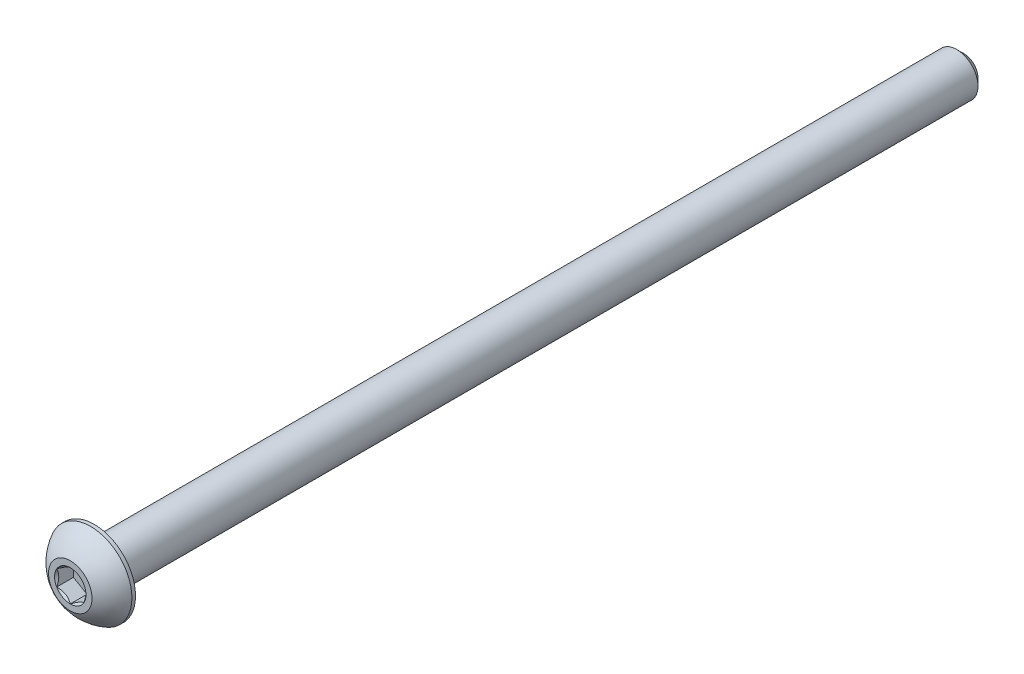
ISO-10303-21;
HEADER;
FILE_DESCRIPTION(('STEP AP214'),'2;1');
FILE_NAME('part.step','',(''),(''),'','','');
FILE_SCHEMA(('AUTOMOTIVE_DESIGN { 1 0 10303 214 1 1 1 1 }'));
ENDSEC;
DATA;
#1=APPLICATION_CONTEXT('core data for automotive mechanical design processes');
#2=APPLICATION_PROTOCOL_DEFINITION('international standard','automotive_design',2000,#1);
#3=PRODUCT_CONTEXT('',#1,'mechanical');
#4=PRODUCT('Part','Part','',(#3));
#5=PRODUCT_RELATED_PRODUCT_CATEGORY('part','',(#4));
#6=PRODUCT_DEFINITION_FORMATION('','',#4);
#7=PRODUCT_DEFINITION_CONTEXT('part definition',#1,'design');
#8=PRODUCT_DEFINITION('design','',#6,#7);
#9=PRODUCT_DEFINITION_SHAPE('','',#8);
#10=(LENGTH_UNIT() NAMED_UNIT(*) SI_UNIT(.MILLI.,.METRE.));
#11=(NAMED_UNIT(*) PLANE_ANGLE_UNIT() SI_UNIT($,.RADIAN.));
#12=(NAMED_UNIT(*) SI_UNIT($,.STERADIAN.) SOLID_ANGLE_UNIT());
#13=UNCERTAINTY_MEASURE_WITH_UNIT(LENGTH_MEASURE(1.E-05),#10,'distance_accuracy_value','');
#14=(GEOMETRIC_REPRESENTATION_CONTEXT(3) GLOBAL_UNCERTAINTY_ASSIGNED_CONTEXT((#13)) GLOBAL_UNIT_ASSIGNED_CONTEXT((#10,
#11,#12)) REPRESENTATION_CONTEXT('',''));
#15=CARTESIAN_POINT('',(0.,0.,0.));
#16=DIRECTION('',(0.,0.,1.));
#17=DIRECTION('',(1.,0.,0.));
#18=AXIS2_PLACEMENT_3D('',#15,#16,#17);
#19=CARTESIAN_POINT('',(1.25,-0.721687836487033,0.660000000000001));
#20=DIRECTION('',(0.,0.,1.));
#21=DIRECTION('',(1.,0.,0.));
#22=AXIS2_PLACEMENT_3D('',#19,#20,#21);
#23=PLANE('',#22);
#24=DIRECTION('',(0.,1.,0.));
#25=VECTOR('',#24,1.);
#26=CARTESIAN_POINT('',(-1.25,0.721687836487031,0.660000000000001));
#27=LINE('',#26,#25);
#28=CARTESIAN_POINT('',(-1.25,0.721687836487031,0.660000000000001));
#29=VERTEX_POINT('',#28);
#30=CARTESIAN_POINT('',(-1.25,-0.721687836487033,0.660000000000001));
#31=VERTEX_POINT('',#30);
#32=EDGE_CURVE('E67',#29,#31,#27,.F.);
#33=ORIENTED_EDGE('',*,*,#32,.T.);
#34=DIRECTION('',(0.866025403784439,-0.5,0.));
#35=VECTOR('',#34,1.);
#36=CARTESIAN_POINT('',(-1.25,-0.721687836487033,0.660000000000001));
#37=LINE('',#36,#35);
#38=CARTESIAN_POINT('',(0.,-1.44337567297406,0.660000000000001));
#39=VERTEX_POINT('',#38);
#40=EDGE_CURVE('E81',#31,#39,#37,.T.);
#41=ORIENTED_EDGE('',*,*,#40,.T.);
#42=DIRECTION('',(0.866025403784438,0.5,0.));
#43=VECTOR('',#42,1.);
#44=CARTESIAN_POINT('',(0.,-1.44337567297406,0.660000000000001));
#45=LINE('',#44,#43);
#46=CARTESIAN_POINT('',(1.25,-0.721687836487033,0.660000000000001));
#47=VERTEX_POINT('',#46);
#48=EDGE_CURVE('E84',#39,#47,#45,.T.);
#49=ORIENTED_EDGE('',*,*,#48,.T.);
#50=DIRECTION('',(0.,1.,0.));
#51=VECTOR('',#50,1.);
#52=CARTESIAN_POINT('',(1.25,-0.721687836487031,0.660000000000001));
#53=LINE('',#52,#51);
#54=CARTESIAN_POINT('',(1.25,0.721687836487033,0.660000000000001));
#55=VERTEX_POINT('',#54);
#56=EDGE_CURVE('E93',#47,#55,#53,.T.);
#57=ORIENTED_EDGE('',*,*,#56,.T.);
#58=DIRECTION('',(-0.866025403784439,0.5,0.));
#59=VECTOR('',#58,1.);
#60=CARTESIAN_POINT('',(1.25,0.721687836487033,0.660000000000001));
#61=LINE('',#60,#59);
#62=CARTESIAN_POINT('',(0.,1.44337567297406,0.660000000000001));
#63=VERTEX_POINT('',#62);
#64=EDGE_CURVE('E385',#55,#63,#61,.T.);
#65=ORIENTED_EDGE('',*,*,#64,.T.);
#66=DIRECTION('',(-0.866025403784438,-0.5,0.));
#67=VECTOR('',#66,1.);
#68=CARTESIAN_POINT('',(0.,1.44337567297406,0.660000000000001));
#69=LINE('',#68,#67);
#70=EDGE_CURVE('E72',#63,#29,#69,.T.);
#71=ORIENTED_EDGE('',*,*,#70,.T.);
#72=EDGE_LOOP('',(#33,#41,#49,#57,#65,#71));
#73=FACE_BOUND('',#72,.T.);
#74=ADVANCED_FACE('F17',(#73),#23,.T.);
#75=CARTESIAN_POINT('',(-1.25,-0.721687836487033,0.660000000000001));
#76=DIRECTION('',(-0.5,-0.866025403784439,0.));
#77=DIRECTION('',(0.866025403784439,-0.5,0.));
#78=AXIS2_PLACEMENT_3D('',#75,#76,#77);
#79=PLANE('',#78);
#80=CARTESIAN_POINT('',(-1.2500000000039,-0.721687836475546,2.1999999999651));
#81=CARTESIAN_POINT('',(-1.20703689150303,-0.746492598739661,2.17521903968037));
#82=CARTESIAN_POINT('',(-1.16335543596248,-0.771712098857023,2.15189374942367));
#83=CARTESIAN_POINT('',(-1.07428446544517,-0.823137247663963,2.10918613886925));
#84=CARTESIAN_POINT('',(-1.02888648444312,-0.849347784215502,2.08982757330815));
#85=CARTESIAN_POINT('',(-0.937343688529335,-0.902200042078223,2.05666621586141));
#86=CARTESIAN_POINT('',(-0.891222174148737,-0.928828310821467,2.04278009673133));
#87=CARTESIAN_POINT('',(-0.79796403889798,-0.982670920312739,2.02138590174697));
#88=CARTESIAN_POINT('',(-0.750830264939867,-1.00988361739533,2.0138618618684));
#89=CARTESIAN_POINT('',(-0.66959091352769,-1.05678717880192,2.00707282774254));
#90=CARTESIAN_POINT('',(-0.635590177990322,-1.07641751261707,2.00606818860084));
#91=CARTESIAN_POINT('',(-0.567648554681464,-1.11564362712362,2.00776349516696));
#92=CARTESIAN_POINT('',(-0.53370768178827,-1.13523939922504,2.01046425920708));
#93=CARTESIAN_POINT('',(-0.466153619741846,-1.17424175513239,2.01941424829));
#94=CARTESIAN_POINT('',(-0.43254076490354,-1.19364814592152,2.02566677300209));
#95=CARTESIAN_POINT('',(-0.365876260763852,-1.23213691533196,2.04138353918999));
#96=CARTESIAN_POINT('',(-0.332824858674677,-1.25121915122524,2.05084915880269));
#97=CARTESIAN_POINT('',(-0.248213569939122,-1.3000695015532,2.07892833152472));
#98=CARTESIAN_POINT('',(-0.197186124432365,-1.32953021095258,2.09964934500926));
#99=CARTESIAN_POINT('',(-0.0971276056170728,-1.38729902372531,2.14632350576772));
#100=CARTESIAN_POINT('',(-0.0480906425307946,-1.41561052756341,2.17225962118124));
#101=CARTESIAN_POINT('',(8.85398045385281E-12,-1.44337567297918,2.19999999996127));
#102=B_SPLINE_CURVE_WITH_KNOTS('',3,(#80,#81,#82,#83,#84,#85,#86,#87,#88,#89,#90,#91,#92,#93,
#94,#95,#96,#97,#98,#99,#100,#101),.UNSPECIFIED.,.F.,.F.,(4,2,2,2,2,2,2,2,2,2,4),(0.,
0.166478683227499,0.333926926836022,0.498716658522913,0.663091654634356,0.780745575566096,
0.898425484358887,1.01621489977747,1.13405490053145,1.32111591643007,1.50757565760963),.UNSPECIFIED.);
#103=CARTESIAN_POINT('',(-1.25000000000471,-0.721687836489752,2.1999999999616));
#104=VERTEX_POINT('',#103);
#105=CARTESIAN_POINT('',(0.,-1.4433756729795,2.19999999996159));
#106=VERTEX_POINT('',#105);
#107=EDGE_CURVE('E20',#104,#106,#102,.T.);
#108=ORIENTED_EDGE('',*,*,#107,.T.);
#109=DIRECTION('',(0.,0.,1.));
#110=VECTOR('',#109,1.);
#111=CARTESIAN_POINT('',(0.,-1.44337567297406,0.660000000000001));
#112=LINE('',#111,#110);
#113=EDGE_CURVE('E88',#106,#39,#112,.F.);
#114=ORIENTED_EDGE('',*,*,#113,.T.);
#115=ORIENTED_EDGE('',*,*,#40,.F.);
#116=DIRECTION('',(0.,0.,1.));
#117=VECTOR('',#116,1.);
#118=CARTESIAN_POINT('',(-1.25,-0.721687836487033,0.660000000000001));
#119=LINE('',#118,#117);
#120=EDGE_CURVE('E59',#31,#104,#119,.T.);
#121=ORIENTED_EDGE('',*,*,#120,.T.);
#122=EDGE_LOOP('',(#108,#114,#115,#121));
#123=FACE_BOUND('',#122,.T.);
#124=ADVANCED_FACE('F89',(#123),#79,.F.);
#125=CARTESIAN_POINT('',(0.,-1.44337567297406,0.660000000000001));
#126=DIRECTION('',(0.5,-0.866025403784438,0.));
#127=DIRECTION('',(0.866025403784438,0.5,0.));
#128=AXIS2_PLACEMENT_3D('',#125,#126,#127);
#129=PLANE('',#128);
#130=CARTESIAN_POINT('',(-1.19006923196776E-11,-1.4433756729717,2.1999999999651));
#131=CARTESIAN_POINT('',(0.0429631084940952,-1.41857091071645,2.17521903968037));
#132=CARTESIAN_POINT('',(0.0866445640367501,-1.39335141060274,2.15189374942367));
#133=CARTESIAN_POINT('',(0.17571553455561,-1.34192626179848,2.10918613886925));
#134=CARTESIAN_POINT('',(0.221113515557087,-1.31571572524595,2.08982757330815));
#135=CARTESIAN_POINT('',(0.312656311470462,-1.26286346738252,2.05666621586141));
#136=CARTESIAN_POINT('',(0.35877782585121,-1.23623519863954,2.04278009673133));
#137=CARTESIAN_POINT('',(0.452035961102074,-1.18239258914845,2.02138590174697));
#138=CARTESIAN_POINT('',(0.499169735060145,-1.15517989206579,2.01386186186839));
#139=CARTESIAN_POINT('',(0.580409086472302,-1.10827633065917,2.00707282774254));
#140=CARTESIAN_POINT('',(0.614409822009676,-1.08864599684402,2.00606818860084));
#141=CARTESIAN_POINT('',(0.682351445318539,-1.04941988233748,2.00776349516696));
#142=CARTESIAN_POINT('',(0.71629231821173,-1.02982411023606,2.01046425920707));
#143=CARTESIAN_POINT('',(0.783846380258153,-0.990821754328704,2.01941424829));
#144=CARTESIAN_POINT('',(0.81745923509646,-0.971415363539577,2.02566677300209));
#145=CARTESIAN_POINT('',(0.884123739236149,-0.932926594129135,2.04138353918999));
#146=CARTESIAN_POINT('',(0.917175141325323,-0.913844358235855,2.05084915880269));
#147=CARTESIAN_POINT('',(1.00178643006088,-0.864994007907901,2.07892833152472));
#148=CARTESIAN_POINT('',(1.05281387556764,-0.835533298508516,2.09964934500926));
#149=CARTESIAN_POINT('',(1.15287239438293,-0.777764485735792,2.14632350576771));
#150=CARTESIAN_POINT('',(1.20190935746921,-0.749452981897688,2.17225962118124));
#151=CARTESIAN_POINT('',(1.25000000000885,-0.721687836481919,2.19999999996127));
#152=B_SPLINE_CURVE_WITH_KNOTS('',3,(#130,#131,#132,#133,#134,#135,#136,#137,#138,#139,#140,
#141,#142,#143,#144,#145,#146,#147,#148,#149,#150,#151),.UNSPECIFIED.,.F.,.F.,(4,2,2,2,2,2,2,2,
2,2,4),(0.,0.166478683227499,0.333926926836022,0.498716658522913,0.663091654634357,
0.780745575566097,0.898425484358887,1.01621489977747,1.13405490053145,1.32111591643007,
1.50757565760963),.UNSPECIFIED.);
#153=CARTESIAN_POINT('',(1.25000000000471,-0.721687836489752,2.19999999996159));
#154=VERTEX_POINT('',#153);
#155=EDGE_CURVE('E202',#106,#154,#152,.T.);
#156=ORIENTED_EDGE('',*,*,#155,.T.);
#157=DIRECTION('',(0.,0.,-1.));
#158=VECTOR('',#157,1.);
#159=CARTESIAN_POINT('',(1.25,-0.721687836487033,0.660000000000001));
#160=LINE('',#159,#158);
#161=EDGE_CURVE('E97',#154,#47,#160,.T.);
#162=ORIENTED_EDGE('',*,*,#161,.T.);
#163=ORIENTED_EDGE('',*,*,#48,.F.);
#164=ORIENTED_EDGE('',*,*,#113,.F.);
#165=EDGE_LOOP('',(#156,#162,#163,#164));
#166=FACE_BOUND('',#165,.T.);
#167=ADVANCED_FACE('F95',(#166),#129,.F.);
#168=CARTESIAN_POINT('',(1.25,-0.721687836487031,0.660000000000001));
#169=DIRECTION('',(1.,0.,0.));
#170=DIRECTION('',(0.,0.,-1.));
#171=AXIS2_PLACEMENT_3D('',#168,#169,#170);
#172=PLANE('',#171);
#173=CARTESIAN_POINT('',(1.249999999992,-0.721687836496157,2.1999999999651));
#174=CARTESIAN_POINT('',(1.24999999999712,-0.672078311964272,2.17521903968134));
#175=CARTESIAN_POINT('',(1.24999999999923,-0.621639311720596,2.15189374942613));
#176=CARTESIAN_POINT('',(1.25000000000078,-0.518789014084217,2.10918613887607));
#177=CARTESIAN_POINT('',(1.2500000000002,-0.466367940967567,2.08982757331785));
#178=CARTESIAN_POINT('',(1.2499999999998,-0.36066342521691,2.05666621587858));
#179=CARTESIAN_POINT('',(1.24999999999994,-0.307406887718766,2.04278009675303));
#180=CARTESIAN_POINT('',(1.25000000000005,-0.19972166871319,2.0213859017793));
#181=CARTESIAN_POINT('',(1.25000000000001,-0.145296274536628,2.01386186190683));
#182=CARTESIAN_POINT('',(1.24999999999999,-0.0514891516972088,2.00707282779183));
#183=CARTESIAN_POINT('',(1.25,-0.0122284840517459,2.00606818865533));
#184=CARTESIAN_POINT('',(1.25,0.0662237449911266,2.00776349523351));
#185=CARTESIAN_POINT('',(1.25,0.105415289208559,2.0104642592805));
#186=CARTESIAN_POINT('',(1.25,0.183420001051808,2.01941424837839));
#187=CARTESIAN_POINT('',(1.25,0.222232782644,2.02566677309857));
#188=CARTESIAN_POINT('',(1.25,0.299210321492129,2.04138353930337));
#189=CARTESIAN_POINT('',(1.25,0.337374793291997,2.05084915892488));
#190=CARTESIAN_POINT('',(1.25,0.435075493903884,2.07892833164773));
#191=CARTESIAN_POINT('',(1.25,0.49399691264761,2.09964934511544));
#192=CARTESIAN_POINT('',(1.25,0.609534538087598,2.14632350582834));
#193=CARTESIAN_POINT('',(1.25,0.666157545713388,2.17225962121314));
#194=CARTESIAN_POINT('',(1.25,0.721687836497259,2.19999999996127));
#195=B_SPLINE_CURVE_WITH_KNOTS('',3,(#173,#174,#175,#176,#177,#178,#179,#180,#181,#182,#183,
#184,#185,#186,#187,#188,#189,#190,#191,#192,#193,#194),.UNSPECIFIED.,.F.,.F.,(4,2,2,2,2,2,2,2,
2,2,4),(0.,0.166478683259841,0.333926926900715,0.498716658618658,0.663091654761128,
0.780745575737858,0.898425484575692,1.01621490003938,1.13405490083847,1.32111591656578,
1.50757565757345),.UNSPECIFIED.);
#196=CARTESIAN_POINT('',(1.25000000000471,0.721687836489753,2.19999999996159));
#197=VERTEX_POINT('',#196);
#198=EDGE_CURVE('E184',#154,#197,#195,.T.);
#199=ORIENTED_EDGE('',*,*,#198,.T.);
#200=DIRECTION('',(0.,0.,1.));
#201=VECTOR('',#200,1.);
#202=CARTESIAN_POINT('',(1.25,0.721687836487033,0.660000000000001));
#203=LINE('',#202,#201);
#204=EDGE_CURVE('E378',#197,#55,#203,.F.);
#205=ORIENTED_EDGE('',*,*,#204,.T.);
#206=ORIENTED_EDGE('',*,*,#56,.F.);
#207=ORIENTED_EDGE('',*,*,#161,.F.);
#208=EDGE_LOOP('',(#199,#205,#206,#207));
#209=FACE_BOUND('',#208,.T.);
#210=ADVANCED_FACE('F174',(#209),#172,.F.);
#211=CARTESIAN_POINT('',(1.25,0.721687836487033,0.660000000000001));
#212=DIRECTION('',(0.5,0.866025403784439,0.));
#213=DIRECTION('',(-0.866025403784439,0.5,0.));
#214=AXIS2_PLACEMENT_3D('',#211,#212,#213);
#215=PLANE('',#214);
#216=CARTESIAN_POINT('',(1.2500000000039,0.721687836475545,2.1999999999651));
#217=CARTESIAN_POINT('',(1.20703689150303,0.746492598739661,2.17521903968037));
#218=CARTESIAN_POINT('',(1.16335543596248,0.771712098857023,2.15189374942367));
#219=CARTESIAN_POINT('',(1.07428446544517,0.823137247663962,2.10918613886925));
#220=CARTESIAN_POINT('',(1.02888648444312,0.849347784215501,2.08982757330815));
#221=CARTESIAN_POINT('',(0.937343688529333,0.902200042078223,2.05666621586141));
#222=CARTESIAN_POINT('',(0.891222174148735,0.928828310821467,2.04278009673133));
#223=CARTESIAN_POINT('',(0.797964038897979,0.982670920312738,2.02138590174697));
#224=CARTESIAN_POINT('',(0.750830264939866,1.00988361739533,2.0138618618684));
#225=CARTESIAN_POINT('',(0.669590913527689,1.05678717880192,2.00707282774254));
#226=CARTESIAN_POINT('',(0.63559017799032,1.07641751261707,2.00606818860084));
#227=CARTESIAN_POINT('',(0.567648554681463,1.11564362712362,2.00776349516696));
#228=CARTESIAN_POINT('',(0.533707681788269,1.13523939922504,2.01046425920707));
#229=CARTESIAN_POINT('',(0.466153619741845,1.17424175513239,2.01941424829));
#230=CARTESIAN_POINT('',(0.432540764903539,1.19364814592152,2.02566677300209));
#231=CARTESIAN_POINT('',(0.365876260763851,1.23213691533196,2.04138353918999));
#232=CARTESIAN_POINT('',(0.332824858674676,1.25121915122524,2.05084915880269));
#233=CARTESIAN_POINT('',(0.248213569939121,1.3000695015532,2.07892833152472));
#234=CARTESIAN_POINT('',(0.197186124432363,1.32953021095258,2.09964934500926));
#235=CARTESIAN_POINT('',(0.0971276056170708,1.3872990237253,2.14632350576771));
#236=CARTESIAN_POINT('',(0.0480906425307926,1.41561052756341,2.17225962118124));
#237=CARTESIAN_POINT('',(-8.85587803845252E-12,1.44337567297918,2.19999999996127));
#238=B_SPLINE_CURVE_WITH_KNOTS('',3,(#216,#217,#218,#219,#220,#221,#222,#223,#224,#225,#226,
#227,#228,#229,#230,#231,#232,#233,#234,#235,#236,#237),.UNSPECIFIED.,.F.,.F.,(4,2,2,2,2,2,2,2,
2,2,4),(0.,0.166478683227499,0.333926926836022,0.498716658522912,0.663091654634356,
0.780745575566096,0.898425484358886,1.01621489977747,1.13405490053145,1.32111591643007,
1.50757565760963),.UNSPECIFIED.);
#239=CARTESIAN_POINT('',(0.,1.4433756729795,2.19999999996159));
#240=VERTEX_POINT('',#239);
#241=EDGE_CURVE('E178',#197,#240,#238,.T.);
#242=ORIENTED_EDGE('',*,*,#241,.T.);
#243=DIRECTION('',(0.,0.,1.));
#244=VECTOR('',#243,1.);
#245=CARTESIAN_POINT('',(0.,1.44337567297406,0.660000000000001));
#246=LINE('',#245,#244);
#247=EDGE_CURVE('E413',#240,#63,#246,.F.);
#248=ORIENTED_EDGE('',*,*,#247,.T.);
#249=ORIENTED_EDGE('',*,*,#64,.F.);
#250=ORIENTED_EDGE('',*,*,#204,.F.);
#251=EDGE_LOOP('',(#242,#248,#249,#250));
#252=FACE_BOUND('',#251,.T.);
#253=ADVANCED_FACE('F170',(#252),#215,.F.);
#254=CARTESIAN_POINT('',(0.,1.44337567297406,0.660000000000001));
#255=DIRECTION('',(-0.5,0.866025403784438,0.));
#256=DIRECTION('',(-0.866025403784438,-0.5,0.));
#257=AXIS2_PLACEMENT_3D('',#254,#255,#256);
#258=PLANE('',#257);
#259=CARTESIAN_POINT('',(1.19001542096313E-11,1.4433756729717,2.1999999999651));
#260=CARTESIAN_POINT('',(-0.0429631084940957,1.41857091071645,2.17521903968037));
#261=CARTESIAN_POINT('',(-0.0866445640367506,1.39335141060274,2.15189374942367));
#262=CARTESIAN_POINT('',(-0.175715534555611,1.34192626179848,2.10918613886925));
#263=CARTESIAN_POINT('',(-0.221113515557087,1.31571572524595,2.08982757330815));
#264=CARTESIAN_POINT('',(-0.312656311470463,1.26286346738252,2.05666621586141));
#265=CARTESIAN_POINT('',(-0.358777825851211,1.23623519863954,2.04278009673133));
#266=CARTESIAN_POINT('',(-0.452035961102075,1.18239258914845,2.02138590174697));
#267=CARTESIAN_POINT('',(-0.499169735060146,1.15517989206579,2.01386186186839));
#268=CARTESIAN_POINT('',(-0.580409086472302,1.10827633065917,2.00707282774254));
#269=CARTESIAN_POINT('',(-0.614409822009677,1.08864599684402,2.00606818860084));
#270=CARTESIAN_POINT('',(-0.682351445318539,1.04941988233748,2.00776349516696));
#271=CARTESIAN_POINT('',(-0.716292318211731,1.02982411023606,2.01046425920707));
#272=CARTESIAN_POINT('',(-0.783846380258154,0.990821754328704,2.01941424829));
#273=CARTESIAN_POINT('',(-0.817459235096461,0.971415363539576,2.02566677300209));
#274=CARTESIAN_POINT('',(-0.884123739236149,0.932926594129135,2.04138353918999));
#275=CARTESIAN_POINT('',(-0.917175141325324,0.913844358235855,2.05084915880269));
#276=CARTESIAN_POINT('',(-1.00178643006088,0.864994007907901,2.07892833152472));
#277=CARTESIAN_POINT('',(-1.05281387556764,0.835533298508516,2.09964934500926));
#278=CARTESIAN_POINT('',(-1.15287239438293,0.777764485735791,2.14632350576771));
#279=CARTESIAN_POINT('',(-1.20190935746921,0.749452981897687,2.17225962118124));
#280=CARTESIAN_POINT('',(-1.25000000000886,0.721687836481918,2.19999999996127));
#281=B_SPLINE_CURVE_WITH_KNOTS('',3,(#259,#260,#261,#262,#263,#264,#265,#266,#267,#268,#269,
#270,#271,#272,#273,#274,#275,#276,#277,#278,#279,#280),.UNSPECIFIED.,.F.,.F.,(4,2,2,2,2,2,2,2,
2,2,4),(0.,0.166478683227499,0.333926926836022,0.498716658522913,0.663091654634357,
0.780745575566097,0.898425484358888,1.01621489977747,1.13405490053145,1.32111591643007,
1.50757565760964),.UNSPECIFIED.);
#282=CARTESIAN_POINT('',(-1.25000000000471,0.72168783648975,2.19999999996159));
#283=VERTEX_POINT('',#282);
#284=EDGE_CURVE('E40',#240,#283,#281,.T.);
#285=ORIENTED_EDGE('',*,*,#284,.T.);
#286=DIRECTION('',(0.,0.,1.));
#287=VECTOR('',#286,1.);
#288=CARTESIAN_POINT('',(-1.25,0.721687836487031,0.660000000000001));
#289=LINE('',#288,#287);
#290=EDGE_CURVE('E403',#283,#29,#289,.F.);
#291=ORIENTED_EDGE('',*,*,#290,.T.);
#292=ORIENTED_EDGE('',*,*,#70,.F.);
#293=ORIENTED_EDGE('',*,*,#247,.F.);
#294=EDGE_LOOP('',(#285,#291,#292,#293));
#295=FACE_BOUND('',#294,.T.);
#296=ADVANCED_FACE('F163',(#295),#258,.F.);
#297=CARTESIAN_POINT('',(-1.25,0.721687836487031,0.660000000000001));
#298=DIRECTION('',(-1.,0.,0.));
#299=DIRECTION('',(0.,0.,1.));
#300=AXIS2_PLACEMENT_3D('',#297,#298,#299);
#301=PLANE('',#300);
#302=CARTESIAN_POINT('',(-1.249999999992,0.721687836496154,2.1999999999651));
#303=CARTESIAN_POINT('',(-1.24999999999712,0.672078311964269,2.17521903968135));
#304=CARTESIAN_POINT('',(-1.24999999999923,0.621639311720593,2.15189374942613));
#305=CARTESIAN_POINT('',(-1.25000000000078,0.518789014084214,2.10918613887607));
#306=CARTESIAN_POINT('',(-1.25000000000021,0.466367940967565,2.08982757331786));
#307=CARTESIAN_POINT('',(-1.2499999999998,0.360663425216908,2.05666621587858));
#308=CARTESIAN_POINT('',(-1.24999999999995,0.307406887718764,2.04278009675303));
#309=CARTESIAN_POINT('',(-1.25000000000005,0.199721668713189,2.0213859017793));
#310=CARTESIAN_POINT('',(-1.25000000000001,0.145296274536628,2.01386186190683));
#311=CARTESIAN_POINT('',(-1.24999999999999,0.0514891516972085,2.00707282779183));
#312=CARTESIAN_POINT('',(-1.25,0.0122284840517456,2.00606818865533));
#313=CARTESIAN_POINT('',(-1.25,-0.066223744991127,2.00776349523352));
#314=CARTESIAN_POINT('',(-1.25,-0.10541528920856,2.01046425928051));
#315=CARTESIAN_POINT('',(-1.25,-0.183420001051808,2.01941424837839));
#316=CARTESIAN_POINT('',(-1.25,-0.222232782644,2.02566677309857));
#317=CARTESIAN_POINT('',(-1.25,-0.29921032149213,2.04138353930337));
#318=CARTESIAN_POINT('',(-1.25,-0.337374793291998,2.05084915892488));
#319=CARTESIAN_POINT('',(-1.25,-0.435075493903885,2.07892833164773));
#320=CARTESIAN_POINT('',(-1.25,-0.493996912647611,2.09964934511545));
#321=CARTESIAN_POINT('',(-1.25,-0.609534538087597,2.14632350582834));
#322=CARTESIAN_POINT('',(-1.25,-0.666157545713387,2.17225962121314));
#323=CARTESIAN_POINT('',(-1.25,-0.721687836497258,2.19999999996127));
#324=B_SPLINE_CURVE_WITH_KNOTS('',3,(#302,#303,#304,#305,#306,#307,#308,#309,#310,#311,#312,
#313,#314,#315,#316,#317,#318,#319,#320,#321,#322,#323),.UNSPECIFIED.,.F.,.F.,(4,2,2,2,2,2,2,2,
2,2,4),(0.,0.166478683259841,0.333926926900713,0.498716658618655,0.663091654761124,
0.780745575737854,0.898425484575689,1.01621490003937,1.13405490083847,1.32111591656577,
1.50757565757345),.UNSPECIFIED.);
#325=EDGE_CURVE('E143',#283,#104,#324,.T.);
#326=ORIENTED_EDGE('',*,*,#325,.T.);
#327=ORIENTED_EDGE('',*,*,#120,.F.);
#328=ORIENTED_EDGE('',*,*,#32,.F.);
#329=ORIENTED_EDGE('',*,*,#290,.F.);
#330=EDGE_LOOP('',(#326,#327,#328,#329));
#331=FACE_BOUND('',#330,.T.);
#332=ADVANCED_FACE('F159',(#331),#301,.F.);
#333=CARTESIAN_POINT('',(0.,0.,2.19999999995935));
#334=DIRECTION('',(0.,0.,1.));
#335=DIRECTION('',(1.,0.,0.));
#336=AXIS2_PLACEMENT_3D('',#333,#334,#335);
#337=CONICAL_SURFACE('',#336,1.44337567297725,0.785398163397448);
#338=ORIENTED_EDGE('',*,*,#107,.F.);
#339=CARTESIAN_POINT('',(0.,0.,2.19999999995935));
#340=DIRECTION('',(0.,0.,1.));
#341=DIRECTION('',(1.,0.,0.));
#342=AXIS2_PLACEMENT_3D('',#339,#340,#341);
#343=CIRCLE('',#342,1.44337567297725);
#344=EDGE_CURVE('E151',#104,#106,#343,.T.);
#345=ORIENTED_EDGE('',*,*,#344,.T.);
#346=EDGE_LOOP('',(#338,#345));
#347=FACE_BOUND('',#346,.T.);
#348=ADVANCED_FACE('F162',(#347),#337,.F.);
#349=CARTESIAN_POINT('',(0.,0.,2.19999999995935));
#350=DIRECTION('',(0.,0.,1.));
#351=DIRECTION('',(1.,0.,0.));
#352=AXIS2_PLACEMENT_3D('',#349,#350,#351);
#353=CONICAL_SURFACE('',#352,1.44337567297725,0.785398163397448);
#354=ORIENTED_EDGE('',*,*,#155,.F.);
#355=CARTESIAN_POINT('',(0.,0.,2.19999999995935));
#356=DIRECTION('',(0.,0.,1.));
#357=DIRECTION('',(1.,0.,0.));
#358=AXIS2_PLACEMENT_3D('',#355,#356,#357);
#359=CIRCLE('',#358,1.44337567297725);
#360=EDGE_CURVE('E391',#106,#154,#359,.T.);
#361=ORIENTED_EDGE('',*,*,#360,.T.);
#362=EDGE_LOOP('',(#354,#361));
#363=FACE_BOUND('',#362,.T.);
#364=ADVANCED_FACE('F197',(#363),#353,.F.);
#365=CARTESIAN_POINT('',(0.,0.,2.19999999995935));
#366=DIRECTION('',(0.,0.,1.));
#367=DIRECTION('',(1.,0.,0.));
#368=AXIS2_PLACEMENT_3D('',#365,#366,#367);
#369=CONICAL_SURFACE('',#368,1.44337567297725,0.785398163543548);
#370=CARTESIAN_POINT('',(0.,0.,2.19999999995935));
#371=DIRECTION('',(0.,0.,1.));
#372=DIRECTION('',(1.,0.,0.));
#373=AXIS2_PLACEMENT_3D('',#370,#371,#372);
#374=CIRCLE('',#373,1.44337567297725);
#375=EDGE_CURVE('E387',#154,#197,#374,.T.);
#376=ORIENTED_EDGE('',*,*,#375,.T.);
#377=ORIENTED_EDGE('',*,*,#198,.F.);
#378=EDGE_LOOP('',(#376,#377));
#379=FACE_BOUND('',#378,.T.);
#380=ADVANCED_FACE('F193',(#379),#369,.F.);
#381=CARTESIAN_POINT('',(0.,0.,2.19999999995935));
#382=DIRECTION('',(0.,0.,1.));
#383=DIRECTION('',(1.,0.,0.));
#384=AXIS2_PLACEMENT_3D('',#381,#382,#383);
#385=CONICAL_SURFACE('',#384,1.44337567297725,0.785398163397448);
#386=ORIENTED_EDGE('',*,*,#241,.F.);
#387=CARTESIAN_POINT('',(0.,0.,2.19999999995935));
#388=DIRECTION('',(0.,0.,1.));
#389=DIRECTION('',(1.,0.,0.));
#390=AXIS2_PLACEMENT_3D('',#387,#388,#389);
#391=CIRCLE('',#390,1.44337567297725);
#392=EDGE_CURVE('E390',#197,#240,#391,.T.);
#393=ORIENTED_EDGE('',*,*,#392,.T.);
#394=EDGE_LOOP('',(#386,#393));
#395=FACE_BOUND('',#394,.T.);
#396=ADVANCED_FACE('F190',(#395),#385,.F.);
#397=CARTESIAN_POINT('',(0.,0.,2.19999999995935));
#398=DIRECTION('',(0.,0.,1.));
#399=DIRECTION('',(1.,0.,0.));
#400=AXIS2_PLACEMENT_3D('',#397,#398,#399);
#401=CONICAL_SURFACE('',#400,1.44337567297725,0.785398163397448);
#402=ORIENTED_EDGE('',*,*,#284,.F.);
#403=CARTESIAN_POINT('',(0.,0.,2.19999999995935));
#404=DIRECTION('',(0.,0.,1.));
#405=DIRECTION('',(1.,0.,0.));
#406=AXIS2_PLACEMENT_3D('',#403,#404,#405);
#407=CIRCLE('',#406,1.44337567297725);
#408=EDGE_CURVE('E397',#240,#283,#407,.T.);
#409=ORIENTED_EDGE('',*,*,#408,.T.);
#410=EDGE_LOOP('',(#402,#409));
#411=FACE_BOUND('',#410,.T.);
#412=ADVANCED_FACE('F138',(#411),#401,.F.);
#413=CARTESIAN_POINT('',(0.,0.,2.19999999995935));
#414=DIRECTION('',(0.,0.,1.));
#415=DIRECTION('',(1.,0.,0.));
#416=AXIS2_PLACEMENT_3D('',#413,#414,#415);
#417=CONICAL_SURFACE('',#416,1.44337567297725,0.785398163543548);
#418=ORIENTED_EDGE('',*,*,#325,.F.);
#419=CARTESIAN_POINT('',(0.,0.,2.19999999995935));
#420=DIRECTION('',(0.,0.,1.));
#421=DIRECTION('',(1.,0.,0.));
#422=AXIS2_PLACEMENT_3D('',#419,#420,#421);
#423=CIRCLE('',#422,1.44337567297725);
#424=EDGE_CURVE('E123',#283,#104,#423,.T.);
#425=ORIENTED_EDGE('',*,*,#424,.T.);
#426=EDGE_LOOP('',(#418,#425));
#427=FACE_BOUND('',#426,.T.);
#428=ADVANCED_FACE('F133',(#427),#417,.F.);
#429=CARTESIAN_POINT('',(0.,-2.,2.2));
#430=DIRECTION('',(0.,0.,-1.));
#431=DIRECTION('',(-1.,0.,0.));
#432=AXIS2_PLACEMENT_3D('',#429,#430,#431);
#433=PLANE('',#432);
#434=ORIENTED_EDGE('',*,*,#408,.F.);
#435=ORIENTED_EDGE('',*,*,#392,.F.);
#436=ORIENTED_EDGE('',*,*,#375,.F.);
#437=ORIENTED_EDGE('',*,*,#360,.F.);
#438=ORIENTED_EDGE('',*,*,#344,.F.);
#439=ORIENTED_EDGE('',*,*,#424,.F.);
#440=EDGE_LOOP('',(#434,#435,#436,#437,#438,#439));
#441=FACE_BOUND('',#440,.T.);
#442=CARTESIAN_POINT('',(0.,2.00000000000002,2.2));
#443=CARTESIAN_POINT('',(-0.112340883932911,1.99999501830892,2.20000000000006));
#444=CARTESIAN_POINT('',(-0.224763225593509,1.99050288387284,2.20000000000027));
#445=CARTESIAN_POINT('',(-0.44651172679388,1.95276859922379,2.19999999999973));
#446=CARTESIAN_POINT('',(-0.555833994612159,1.92450388247339,2.19999999999898));
#447=CARTESIAN_POINT('',(-0.768137698049013,1.85002906418695,2.1999999999991));
#448=CARTESIAN_POINT('',(-0.871122134819574,1.80382753320624,2.19999999999996));
#449=CARTESIAN_POINT('',(-1.06784380972381,1.69480235085556,2.20000000000004));
#450=CARTESIAN_POINT('',(-1.1615833392864,1.63198283268136,2.19999999999927));
#451=CARTESIAN_POINT('',(-1.33719709830382,1.49149220719558,2.19999999999913));
#452=CARTESIAN_POINT('',(-1.41907008513779,1.41381954648975,2.19999999999977));
#453=CARTESIAN_POINT('',(-1.568616871776,1.24582829627509,2.20000000000023));
#454=CARTESIAN_POINT('',(-1.63629011398114,1.1555092103954,2.20000000000006));
#455=CARTESIAN_POINT('',(-1.75551140838452,0.964793228617701,2.19999999999994));
#456=CARTESIAN_POINT('',(-1.80705976087957,0.864396520443118,2.19999999999998));
#457=CARTESIAN_POINT('',(-1.89256952340775,0.656374060165247,2.20000000000002));
#458=CARTESIAN_POINT('',(-1.92653096880462,0.548748322598583,2.20000000000001));
#459=CARTESIAN_POINT('',(-1.9759030761069,0.329322588612881,2.2));
#460=CARTESIAN_POINT('',(-1.99131370264777,0.217522584236605,2.2));
#461=CARTESIAN_POINT('',(-2.00314657525841,-0.00707760750866506,2.2));
#462=CARTESIAN_POINT('',(-1.99956885554329,-0.119877793075066,2.2));
#463=CARTESIAN_POINT('',(-1.97352667238584,-0.343276528884567,2.2));
#464=CARTESIAN_POINT('',(-1.95106220189599,-0.453875078306119,2.2));
#465=CARTESIAN_POINT('',(-1.88788417341463,-0.669731048185603,2.2));
#466=CARTESIAN_POINT('',(-1.84717059615923,-0.774988463005267,2.2));
#467=CARTESIAN_POINT('',(-1.74865010522097,-0.977174053294483,2.2));
#468=CARTESIAN_POINT('',(-1.69084319710065,-1.07410223147453,2.2));
#469=CARTESIAN_POINT('',(-1.55977703496567,-1.25687784284644,2.2));
#470=CARTESIAN_POINT('',(-1.48651778720562,-1.34272528052338,2.2));
#471=CARTESIAN_POINT('',(-1.32662653450797,-1.50090251249223,2.2));
#472=CARTESIAN_POINT('',(-1.23999452773776,-1.57323230493166,2.2));
#473=CARTESIAN_POINT('',(-1.05581697990551,-1.70232101036837,2.2));
#474=CARTESIAN_POINT('',(-0.958271437417261,-1.75907992133081,2.2));
#475=CARTESIAN_POINT('',(-0.755035863250458,-1.8554156303996,2.20000000000001));
#476=CARTESIAN_POINT('',(-0.64934583192062,-1.89499242924162,2.20000000000002));
#477=CARTESIAN_POINT('',(-0.432821510670028,-1.95584044724504,2.19999999999998));
#478=CARTESIAN_POINT('',(-0.321987220981027,-1.97711166723111,2.19999999999993));
#479=CARTESIAN_POINT('',(-0.0983206380605844,-2.00074470318099,2.20000000000007));
#480=CARTESIAN_POINT('',(0.0145116551708551,-2.0031065191448,2.20000000000028));
#481=CARTESIAN_POINT('',(0.23897127332826,-1.9888537017191,2.19999999999972));
#482=CARTESIAN_POINT('',(0.35059859819994,-1.97223906747469,2.19999999999897));
#483=CARTESIAN_POINT('',(0.569479507471835,-1.92050498775071,2.19999999999909));
#484=CARTESIAN_POINT('',(0.676733091684778,-1.88538554147881,2.19999999999998));
#485=CARTESIAN_POINT('',(0.883821886677245,-1.79763878093745,2.20000000000003));
#486=CARTESIAN_POINT('',(0.983657098426224,-1.74501146895596,2.19999999999919));
#487=CARTESIAN_POINT('',(1.1730751232143,-1.62374291867219,2.19999999999905));
#488=CARTESIAN_POINT('',(1.26265793765838,-1.55510168256446,2.19999999999975));
#489=CARTESIAN_POINT('',(1.42902822576513,-1.40375377143033,2.20000000000025));
#490=CARTESIAN_POINT('',(1.50581569424865,-1.32104709071073,2.20000000000007));
#491=CARTESIAN_POINT('',(1.64441549755369,-1.143916081062,2.19999999999993));
#492=CARTESIAN_POINT('',(1.70622782750199,-1.04949174831972,2.19999999999998));
#493=CARTESIAN_POINT('',(1.81312259248705,-0.851605992808602,2.20000000000002));
#494=CARTESIAN_POINT('',(1.85820504518396,-0.748144579579492,2.20000000000001));
#495=CARTESIAN_POINT('',(1.93036037779898,-0.535121579788186,2.2));
#496=CARTESIAN_POINT('',(1.95743326443729,-0.425559995502262,2.2));
#497=CARTESIAN_POINT('',(1.99280100395235,-0.203446542492709,2.2));
#498=CARTESIAN_POINT('',(2.00109582299281,-0.0908946683812334,2.2));
#499=CARTESIAN_POINT('',(1.9986718691442,0.13400393579938,2.2));
#500=CARTESIAN_POINT('',(1.98795313250172,0.246350666259186,2.2));
#501=CARTESIAN_POINT('',(1.94780635101612,0.467650235630702,2.2));
#502=CARTESIAN_POINT('',(1.91837826855214,0.576603067717481,2.2));
#503=CARTESIAN_POINT('',(1.84164749436852,0.788023717224044,2.2));
#504=CARTESIAN_POINT('',(1.79434446975091,0.890491413824967,2.2));
#505=CARTESIAN_POINT('',(1.68320860722375,1.08602688785112,2.2));
#506=CARTESIAN_POINT('',(1.61937641833701,1.17909503415324,2.2));
#507=CARTESIAN_POINT('',(1.47700183277597,1.35318491206687,2.2));
#508=CARTESIAN_POINT('',(1.39846097592722,1.43420790307403,2.2));
#509=CARTESIAN_POINT('',(1.22886860673972,1.58193852304531,2.2));
#510=CARTESIAN_POINT('',(1.13781398977336,1.64864258897124,2.2));
#511=CARTESIAN_POINT('',(0.945762980525375,1.76584229417067,2.2));
#512=CARTESIAN_POINT('',(0.844761862199252,1.81633017935909,2.2));
#513=CARTESIAN_POINT('',(0.63579619454782,1.89957454112382,2.2));
#514=CARTESIAN_POINT('',(0.52784016719848,1.93235227258274,2.19999999999999));
#515=CARTESIAN_POINT('',(0.349330109791197,1.97050988941559,2.2));
#516=CARTESIAN_POINT('',(0.27993599820657,1.98155487929512,2.20000000000001));
#517=CARTESIAN_POINT('',(0.140371860834155,1.99630149111708,2.19999999999999));
#518=CARTESIAN_POINT('',(0.0702018350463665,2.00000311305952,2.19999999999997));
#519=CARTESIAN_POINT('',(0.,2.00000000000002,2.2));
#520=B_SPLINE_CURVE_WITH_KNOTS('',3,(#442,#443,#444,#445,#446,#447,#448,#449,#450,#451,#452,
#453,#454,#455,#456,#457,#458,#459,#460,#461,#462,#463,#464,#465,#466,#467,#468,#469,#470,#471,
#472,#473,#474,#475,#476,#477,#478,#479,#480,#481,#482,#483,#484,#485,#486,#487,#488,#489,#490,
#491,#492,#493,#494,#495,#496,#497,#498,#499,#500,#501,#502,#503,#504,#505,#506,#507,#508,#509,
#510,#511,#512,#513,#514,#515,#516,#517,#518,#519),.UNSPECIFIED.,.T.,.F.,(4,2,2,2,2,2,2,2,2,2,2,
2,2,2,2,2,2,2,2,2,2,2,2,2,2,2,2,2,2,2,2,2,2,2,2,2,2,2,4),(0.,0.336766415247732,
0.673938392179692,1.01094945973899,1.34787678519445,1.6848393669933,2.02181517824711,
2.35878471356389,2.69575357129968,3.03272307141856,3.36969196435224,3.70666098302472,
4.04363035740481,4.38059962212797,4.71756875045738,5.05453792496558,5.39150714350995,
5.72847634762656,6.06544553656251,6.40241472549818,6.73938392961451,7.07635314815893,
7.41332232266716,7.75029145099705,8.0872607157208,8.42423009010093,8.76119910877336,
9.09816800170701,9.43513750182593,9.77210635956176,10.1090758948785,10.4460517061318,
10.7830142879301,11.1199416133859,11.4569526809455,11.7941246578779,12.1308910731259,
12.3413364560063,12.5517818388867),.UNSPECIFIED.);
#521=CARTESIAN_POINT('',(0.,2.00000000000002,2.2));
#522=VERTEX_POINT('',#521);
#523=EDGE_CURVE('E115',#522,#522,#520,.F.);
#524=ORIENTED_EDGE('',*,*,#523,.F.);
#525=EDGE_LOOP('',(#524));
#526=FACE_BOUND('',#525,.T.);
#527=ADVANCED_FACE('F129',(#441,#526),#433,.F.);
#528=CARTESIAN_POINT('',(0.,0.,-1.52644385026738));
#529=DIRECTION('',(0.,-1.,0.));
#530=DIRECTION('',(0.,0.,-1.));
#531=AXIS2_PLACEMENT_3D('',#528,#529,#530);
#532=SPHERICAL_SURFACE('',#531,4.22922968981298);
#533=ORIENTED_EDGE('',*,*,#523,.T.);
#534=EDGE_LOOP('',(#533));
#535=FACE_BOUND('',#534,.T.);
#536=CARTESIAN_POINT('',(0.,0.,0.330000000000001));
#537=DIRECTION('',(0.,0.,1.));
#538=DIRECTION('',(1.,0.,0.));
#539=AXIS2_PLACEMENT_3D('',#536,#537,#538);
#540=CIRCLE('',#539,3.79999999999999);
#541=CARTESIAN_POINT('',(3.79999999999999,0.,0.330000000000001));
#542=VERTEX_POINT('',#541);
#543=EDGE_CURVE('E112',#542,#542,#540,.F.);
#544=ORIENTED_EDGE('',*,*,#543,.F.);
#545=EDGE_LOOP('',(#544));
#546=FACE_BOUND('',#545,.T.);
#547=ADVANCED_FACE('F125',(#535,#546),#532,.T.);
#548=CARTESIAN_POINT('',(0.,-1.99999999999998,-80.));
#549=DIRECTION('',(0.,0.,-1.));
#550=DIRECTION('',(0.,1.,0.));
#551=AXIS2_PLACEMENT_3D('',#548,#549,#550);
#552=PLANE('',#551);
#553=CARTESIAN_POINT('',(0.,0.,-80.0000000000409));
#554=DIRECTION('',(0.,0.,1.));
#555=DIRECTION('',(1.,0.,0.));
#556=AXIS2_PLACEMENT_3D('',#553,#554,#555);
#557=CIRCLE('',#556,1.28000000000839);
#558=CARTESIAN_POINT('',(1.28000000000839,0.,-80.0000000000409));
#559=VERTEX_POINT('',#558);
#560=EDGE_CURVE('E109',#559,#559,#557,.T.);
#561=ORIENTED_EDGE('',*,*,#560,.F.);
#562=EDGE_LOOP('',(#561));
#563=FACE_BOUND('',#562,.T.);
#564=ADVANCED_FACE('F233',(#563),#552,.T.);
#565=CARTESIAN_POINT('',(0.,0.,2.2));
#566=DIRECTION('',(0.,0.,1.));
#567=DIRECTION('',(1.,0.,0.));
#568=AXIS2_PLACEMENT_3D('',#565,#566,#567);
#569=CYLINDRICAL_SURFACE('',#568,3.79999999999999);
#570=CARTESIAN_POINT('',(0.,0.,0.));
#571=DIRECTION('',(0.,0.,1.));
#572=DIRECTION('',(1.,0.,0.));
#573=AXIS2_PLACEMENT_3D('',#570,#571,#572);
#574=CIRCLE('',#573,3.79999999999999);
#575=CARTESIAN_POINT('',(3.79999999999999,0.,0.));
#576=VERTEX_POINT('',#575);
#577=EDGE_CURVE('E106',#576,#576,#574,.T.);
#578=ORIENTED_EDGE('',*,*,#577,.T.);
#579=EDGE_LOOP('',(#578));
#580=FACE_BOUND('',#579,.T.);
#581=ORIENTED_EDGE('',*,*,#543,.T.);
#582=EDGE_LOOP('',(#581));
#583=FACE_BOUND('',#582,.T.);
#584=ADVANCED_FACE('F230',(#580,#583),#569,.T.);
#585=CARTESIAN_POINT('',(0.,0.,-79.3259999999805));
#586=DIRECTION('',(0.,0.,1.));
#587=DIRECTION('',(1.,0.,0.));
#588=AXIS2_PLACEMENT_3D('',#585,#586,#587);
#589=CONICAL_SURFACE('',#588,1.95400000006885,0.785398163397448);
#590=CARTESIAN_POINT('',(0.,0.,-79.3259999999999));
#591=DIRECTION('',(0.,0.,-1.));
#592=DIRECTION('',(0.,1.,0.));
#593=AXIS2_PLACEMENT_3D('',#590,#591,#592);
#594=CIRCLE('',#593,1.954);
#595=CARTESIAN_POINT('',(0.,1.95400000000001,-79.3259999999999));
#596=VERTEX_POINT('',#595);
#597=EDGE_CURVE('E31',#596,#596,#594,.F.);
#598=ORIENTED_EDGE('',*,*,#597,.F.);
#599=EDGE_LOOP('',(#598));
#600=FACE_BOUND('',#599,.T.);
#601=ORIENTED_EDGE('',*,*,#560,.T.);
#602=EDGE_LOOP('',(#601));
#603=FACE_BOUND('',#602,.T.);
#604=ADVANCED_FACE('F223',(#600,#603),#589,.T.);
#605=CARTESIAN_POINT('',(0.,-3.79999999999999,0.));
#606=DIRECTION('',(0.,0.,1.));
#607=DIRECTION('',(1.,0.,0.));
#608=AXIS2_PLACEMENT_3D('',#605,#606,#607);
#609=PLANE('',#608);
#610=CARTESIAN_POINT('',(0.,0.,0.));
#611=DIRECTION('',(0.,0.,-1.));
#612=DIRECTION('',(0.,1.,0.));
#613=AXIS2_PLACEMENT_3D('',#610,#611,#612);
#614=CIRCLE('',#613,1.954);
#615=CARTESIAN_POINT('',(0.,1.954,0.));
#616=VERTEX_POINT('',#615);
#617=EDGE_CURVE('E11',#616,#616,#614,.T.);
#618=ORIENTED_EDGE('',*,*,#617,.F.);
#619=EDGE_LOOP('',(#618));
#620=FACE_BOUND('',#619,.T.);
#621=ORIENTED_EDGE('',*,*,#577,.F.);
#622=EDGE_LOOP('',(#621));
#623=FACE_BOUND('',#622,.T.);
#624=ADVANCED_FACE('F217',(#620,#623),#609,.F.);
#625=CARTESIAN_POINT('',(0.,0.,-80.));
#626=DIRECTION('',(0.,0.,-1.));
#627=DIRECTION('',(0.,1.,0.));
#628=AXIS2_PLACEMENT_3D('',#625,#626,#627);
#629=CYLINDRICAL_SURFACE('',#628,1.954);
#630=ORIENTED_EDGE('',*,*,#617,.T.);
#631=EDGE_LOOP('',(#630));
#632=FACE_BOUND('',#631,.T.);
#633=ORIENTED_EDGE('',*,*,#597,.T.);
#634=EDGE_LOOP('',(#633));
#635=FACE_BOUND('',#634,.T.);
#636=ADVANCED_FACE('F215',(#632,#635),#629,.T.);
#637=CLOSED_SHELL('',(#74,#124,#167,#210,#253,#296,#332,#348,#364,#380,#396,#412,#428,#527,#547,
#564,#584,#604,#624,#636));
#638=MANIFOLD_SOLID_BREP('B1',#637);
#639=ADVANCED_BREP_SHAPE_REPRESENTATION('',(#18,#638),#14);
#640=SHAPE_DEFINITION_REPRESENTATION(#9,#639);
ENDSEC;
END-ISO-10303-21;
